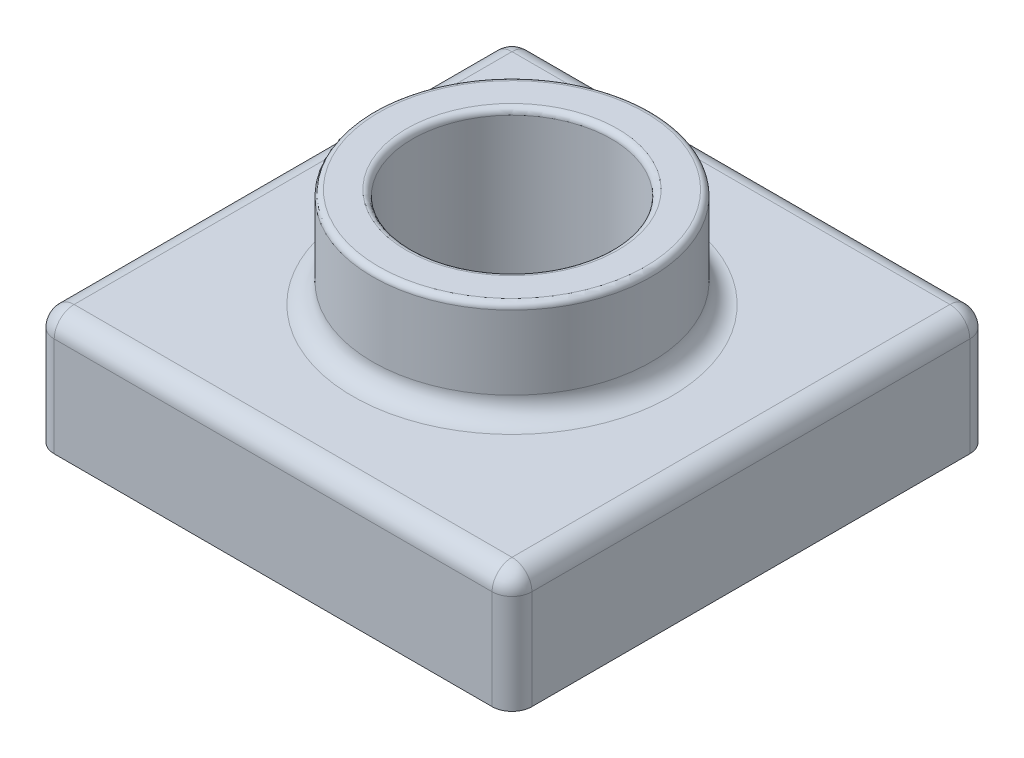
ISO-10303-21;
HEADER;
FILE_DESCRIPTION(('STEP AP214'),'2;1');
FILE_NAME('part.step','',(''),(''),'','','');
FILE_SCHEMA(('AUTOMOTIVE_DESIGN { 1 0 10303 214 1 1 1 1 }'));
ENDSEC;
DATA;
#1=APPLICATION_CONTEXT('core data for automotive mechanical design processes');
#2=APPLICATION_PROTOCOL_DEFINITION('international standard','automotive_design',2000,#1);
#3=PRODUCT_CONTEXT('',#1,'mechanical');
#4=PRODUCT('Part','Part','',(#3));
#5=PRODUCT_RELATED_PRODUCT_CATEGORY('part','',(#4));
#6=PRODUCT_DEFINITION_FORMATION('','',#4);
#7=PRODUCT_DEFINITION_CONTEXT('part definition',#1,'design');
#8=PRODUCT_DEFINITION('design','',#6,#7);
#9=PRODUCT_DEFINITION_SHAPE('','',#8);
#10=(LENGTH_UNIT() NAMED_UNIT(*) SI_UNIT(.MILLI.,.METRE.));
#11=(NAMED_UNIT(*) PLANE_ANGLE_UNIT() SI_UNIT($,.RADIAN.));
#12=(NAMED_UNIT(*) SI_UNIT($,.STERADIAN.) SOLID_ANGLE_UNIT());
#13=UNCERTAINTY_MEASURE_WITH_UNIT(LENGTH_MEASURE(1.E-05),#10,'distance_accuracy_value','');
#14=(GEOMETRIC_REPRESENTATION_CONTEXT(3) GLOBAL_UNCERTAINTY_ASSIGNED_CONTEXT((#13)) GLOBAL_UNIT_ASSIGNED_CONTEXT((#10,
#11,#12)) REPRESENTATION_CONTEXT('',''));
#15=CARTESIAN_POINT('',(0.,0.,0.));
#16=DIRECTION('',(0.,0.,1.));
#17=DIRECTION('',(1.,0.,0.));
#18=AXIS2_PLACEMENT_3D('',#15,#16,#17);
#19=CARTESIAN_POINT('',(0.,0.,0.));
#20=DIRECTION('',(0.,-1.,0.));
#21=DIRECTION('',(0.,0.,-1.));
#22=AXIS2_PLACEMENT_3D('',#19,#20,#21);
#23=PLANE('',#22);
#24=DIRECTION('',(0.,0.,-1.));
#25=VECTOR('',#24,1.);
#26=CARTESIAN_POINT('',(60.,0.,60.));
#27=LINE('',#26,#25);
#28=CARTESIAN_POINT('',(60.,0.,55.));
#29=VERTEX_POINT('',#28);
#30=CARTESIAN_POINT('',(60.,0.,-55.));
#31=VERTEX_POINT('',#30);
#32=EDGE_CURVE('E349',#29,#31,#27,.T.);
#33=ORIENTED_EDGE('',*,*,#32,.F.);
#34=CARTESIAN_POINT('',(55.,0.,55.));
#35=DIRECTION('',(0.,-1.,0.));
#36=DIRECTION('',(0.,0.,-1.));
#37=AXIS2_PLACEMENT_3D('',#34,#35,#36);
#38=CIRCLE('',#37,5.);
#39=CARTESIAN_POINT('',(55.,0.,60.));
#40=VERTEX_POINT('',#39);
#41=EDGE_CURVE('E406',#29,#40,#38,.T.);
#42=ORIENTED_EDGE('',*,*,#41,.T.);
#43=DIRECTION('',(1.,0.,0.));
#44=VECTOR('',#43,1.);
#45=CARTESIAN_POINT('',(-60.,0.,60.));
#46=LINE('',#45,#44);
#47=CARTESIAN_POINT('',(-55.,0.,60.));
#48=VERTEX_POINT('',#47);
#49=EDGE_CURVE('E362',#48,#40,#46,.T.);
#50=ORIENTED_EDGE('',*,*,#49,.F.);
#51=CARTESIAN_POINT('',(-55.,0.,55.));
#52=DIRECTION('',(0.,-1.,0.));
#53=DIRECTION('',(0.,0.,-1.));
#54=AXIS2_PLACEMENT_3D('',#51,#52,#53);
#55=CIRCLE('',#54,5.);
#56=CARTESIAN_POINT('',(-60.,0.,55.));
#57=VERTEX_POINT('',#56);
#58=EDGE_CURVE('E403',#48,#57,#55,.T.);
#59=ORIENTED_EDGE('',*,*,#58,.T.);
#60=DIRECTION('',(0.,0.,1.));
#61=VECTOR('',#60,1.);
#62=CARTESIAN_POINT('',(-60.,0.,60.));
#63=LINE('',#62,#61);
#64=CARTESIAN_POINT('',(-60.,0.,-55.));
#65=VERTEX_POINT('',#64);
#66=EDGE_CURVE('E358',#65,#57,#63,.T.);
#67=ORIENTED_EDGE('',*,*,#66,.F.);
#68=CARTESIAN_POINT('',(-55.,0.,-55.));
#69=DIRECTION('',(0.,-1.,0.));
#70=DIRECTION('',(0.,0.,-1.));
#71=AXIS2_PLACEMENT_3D('',#68,#69,#70);
#72=CIRCLE('',#71,5.);
#73=CARTESIAN_POINT('',(-55.,0.,-60.));
#74=VERTEX_POINT('',#73);
#75=EDGE_CURVE('E397',#65,#74,#72,.T.);
#76=ORIENTED_EDGE('',*,*,#75,.T.);
#77=DIRECTION('',(-1.,0.,0.));
#78=VECTOR('',#77,1.);
#79=CARTESIAN_POINT('',(-60.,0.,-60.));
#80=LINE('',#79,#78);
#81=CARTESIAN_POINT('',(55.,0.,-60.));
#82=VERTEX_POINT('',#81);
#83=EDGE_CURVE('E354',#82,#74,#80,.T.);
#84=ORIENTED_EDGE('',*,*,#83,.F.);
#85=CARTESIAN_POINT('',(55.,0.,-55.));
#86=DIRECTION('',(0.,-1.,0.));
#87=DIRECTION('',(0.,0.,-1.));
#88=AXIS2_PLACEMENT_3D('',#85,#86,#87);
#89=CIRCLE('',#88,5.);
#90=EDGE_CURVE('E400',#82,#31,#89,.T.);
#91=ORIENTED_EDGE('',*,*,#90,.T.);
#92=EDGE_LOOP('',(#33,#42,#50,#59,#67,#76,#84,#91));
#93=FACE_BOUND('',#92,.T.);
#94=CARTESIAN_POINT('',(55.,0.,55.));
#95=DIRECTION('',(0.,-1.,0.));
#96=DIRECTION('',(0.,0.,-1.));
#97=AXIS2_PLACEMENT_3D('',#94,#95,#96);
#98=CIRCLE('',#97,3.);
#99=CARTESIAN_POINT('',(58.,0.,55.));
#100=VERTEX_POINT('',#99);
#101=CARTESIAN_POINT('',(55.,0.,58.));
#102=VERTEX_POINT('',#101);
#103=EDGE_CURVE('E313',#100,#102,#98,.T.);
#104=ORIENTED_EDGE('',*,*,#103,.F.);
#105=DIRECTION('',(0.,0.,-1.));
#106=VECTOR('',#105,1.);
#107=CARTESIAN_POINT('',(58.,0.,0.));
#108=LINE('',#107,#106);
#109=CARTESIAN_POINT('',(58.,0.,-55.));
#110=VERTEX_POINT('',#109);
#111=EDGE_CURVE('E218',#100,#110,#108,.T.);
#112=ORIENTED_EDGE('',*,*,#111,.T.);
#113=CARTESIAN_POINT('',(55.,0.,-55.));
#114=DIRECTION('',(0.,-1.,0.));
#115=DIRECTION('',(0.,0.,-1.));
#116=AXIS2_PLACEMENT_3D('',#113,#114,#115);
#117=CIRCLE('',#116,3.);
#118=CARTESIAN_POINT('',(55.,0.,-58.));
#119=VERTEX_POINT('',#118);
#120=EDGE_CURVE('E226',#119,#110,#117,.T.);
#121=ORIENTED_EDGE('',*,*,#120,.F.);
#122=DIRECTION('',(-1.,0.,0.));
#123=VECTOR('',#122,1.);
#124=CARTESIAN_POINT('',(0.,0.,-58.));
#125=LINE('',#124,#123);
#126=CARTESIAN_POINT('',(-55.,0.,-58.));
#127=VERTEX_POINT('',#126);
#128=EDGE_CURVE('E59',#119,#127,#125,.T.);
#129=ORIENTED_EDGE('',*,*,#128,.T.);
#130=CARTESIAN_POINT('',(-55.,0.,-55.));
#131=DIRECTION('',(0.,-1.,0.));
#132=DIRECTION('',(0.,0.,-1.));
#133=AXIS2_PLACEMENT_3D('',#130,#131,#132);
#134=CIRCLE('',#133,3.);
#135=CARTESIAN_POINT('',(-58.,0.,-55.));
#136=VERTEX_POINT('',#135);
#137=EDGE_CURVE('E221',#136,#127,#134,.T.);
#138=ORIENTED_EDGE('',*,*,#137,.F.);
#139=DIRECTION('',(0.,0.,1.));
#140=VECTOR('',#139,1.);
#141=CARTESIAN_POINT('',(-58.,0.,0.));
#142=LINE('',#141,#140);
#143=CARTESIAN_POINT('',(-58.,0.,55.));
#144=VERTEX_POINT('',#143);
#145=EDGE_CURVE('E332',#136,#144,#142,.T.);
#146=ORIENTED_EDGE('',*,*,#145,.T.);
#147=CARTESIAN_POINT('',(-55.,0.,55.));
#148=DIRECTION('',(0.,-1.,0.));
#149=DIRECTION('',(0.,0.,-1.));
#150=AXIS2_PLACEMENT_3D('',#147,#148,#149);
#151=CIRCLE('',#150,3.);
#152=CARTESIAN_POINT('',(-55.,0.,58.));
#153=VERTEX_POINT('',#152);
#154=EDGE_CURVE('E328',#153,#144,#151,.T.);
#155=ORIENTED_EDGE('',*,*,#154,.F.);
#156=DIRECTION('',(1.,0.,0.));
#157=VECTOR('',#156,1.);
#158=CARTESIAN_POINT('',(0.,0.,58.));
#159=LINE('',#158,#157);
#160=EDGE_CURVE('E289',#153,#102,#159,.T.);
#161=ORIENTED_EDGE('',*,*,#160,.T.);
#162=EDGE_LOOP('',(#104,#112,#121,#129,#138,#146,#155,#161));
#163=FACE_BOUND('',#162,.T.);
#164=ADVANCED_FACE('F43',(#93,#163),#23,.T.);
#165=CARTESIAN_POINT('',(60.,30.,60.));
#166=DIRECTION('',(-1.,0.,0.));
#167=DIRECTION('',(0.,0.,1.));
#168=AXIS2_PLACEMENT_3D('',#165,#166,#167);
#169=PLANE('',#168);
#170=DIRECTION('',(0.,0.,-1.));
#171=VECTOR('',#170,1.);
#172=CARTESIAN_POINT('',(60.,25.,60.));
#173=LINE('',#172,#171);
#174=CARTESIAN_POINT('',(60.,25.,-55.));
#175=VERTEX_POINT('',#174);
#176=CARTESIAN_POINT('',(60.,25.,55.));
#177=VERTEX_POINT('',#176);
#178=EDGE_CURVE('E387',#175,#177,#173,.F.);
#179=ORIENTED_EDGE('',*,*,#178,.T.);
#180=DIRECTION('',(0.,-1.,0.));
#181=VECTOR('',#180,1.);
#182=CARTESIAN_POINT('',(60.,30.,55.));
#183=LINE('',#182,#181);
#184=EDGE_CURVE('E393',#177,#29,#183,.T.);
#185=ORIENTED_EDGE('',*,*,#184,.T.);
#186=ORIENTED_EDGE('',*,*,#32,.T.);
#187=DIRECTION('',(0.,-1.,0.));
#188=VECTOR('',#187,1.);
#189=CARTESIAN_POINT('',(60.,30.,-55.));
#190=LINE('',#189,#188);
#191=EDGE_CURVE('E390',#31,#175,#190,.F.);
#192=ORIENTED_EDGE('',*,*,#191,.T.);
#193=EDGE_LOOP('',(#179,#185,#186,#192));
#194=FACE_BOUND('',#193,.T.);
#195=ADVANCED_FACE('F528',(#194),#169,.F.);
#196=CARTESIAN_POINT('',(-60.,30.,-60.));
#197=DIRECTION('',(0.,0.,1.));
#198=DIRECTION('',(1.,0.,0.));
#199=AXIS2_PLACEMENT_3D('',#196,#197,#198);
#200=PLANE('',#199);
#201=DIRECTION('',(-1.,0.,0.));
#202=VECTOR('',#201,1.);
#203=CARTESIAN_POINT('',(-60.,25.,-60.));
#204=LINE('',#203,#202);
#205=CARTESIAN_POINT('',(-55.,25.,-60.));
#206=VERTEX_POINT('',#205);
#207=CARTESIAN_POINT('',(55.,25.,-60.));
#208=VERTEX_POINT('',#207);
#209=EDGE_CURVE('E67',#206,#208,#204,.F.);
#210=ORIENTED_EDGE('',*,*,#209,.T.);
#211=DIRECTION('',(0.,-1.,0.));
#212=VECTOR('',#211,1.);
#213=CARTESIAN_POINT('',(55.,30.,-60.));
#214=LINE('',#213,#212);
#215=EDGE_CURVE('E432',#208,#82,#214,.T.);
#216=ORIENTED_EDGE('',*,*,#215,.T.);
#217=ORIENTED_EDGE('',*,*,#83,.T.);
#218=DIRECTION('',(0.,-1.,0.));
#219=VECTOR('',#218,1.);
#220=CARTESIAN_POINT('',(-55.,30.,-60.));
#221=LINE('',#220,#219);
#222=EDGE_CURVE('E427',#74,#206,#221,.F.);
#223=ORIENTED_EDGE('',*,*,#222,.T.);
#224=EDGE_LOOP('',(#210,#216,#217,#223));
#225=FACE_BOUND('',#224,.T.);
#226=ADVANCED_FACE('F534',(#225),#200,.F.);
#227=CARTESIAN_POINT('',(-60.,30.,60.));
#228=DIRECTION('',(1.,0.,0.));
#229=DIRECTION('',(0.,0.,-1.));
#230=AXIS2_PLACEMENT_3D('',#227,#228,#229);
#231=PLANE('',#230);
#232=ORIENTED_EDGE('',*,*,#66,.T.);
#233=DIRECTION('',(0.,-1.,0.));
#234=VECTOR('',#233,1.);
#235=CARTESIAN_POINT('',(-60.,30.,55.));
#236=LINE('',#235,#234);
#237=CARTESIAN_POINT('',(-60.,25.,55.));
#238=VERTEX_POINT('',#237);
#239=EDGE_CURVE('E424',#57,#238,#236,.F.);
#240=ORIENTED_EDGE('',*,*,#239,.T.);
#241=DIRECTION('',(0.,0.,1.));
#242=VECTOR('',#241,1.);
#243=CARTESIAN_POINT('',(-60.,25.,60.));
#244=LINE('',#243,#242);
#245=CARTESIAN_POINT('',(-60.,25.,-55.));
#246=VERTEX_POINT('',#245);
#247=EDGE_CURVE('E421',#238,#246,#244,.F.);
#248=ORIENTED_EDGE('',*,*,#247,.T.);
#249=DIRECTION('',(0.,-1.,0.));
#250=VECTOR('',#249,1.);
#251=CARTESIAN_POINT('',(-60.,30.,-55.));
#252=LINE('',#251,#250);
#253=EDGE_CURVE('E418',#246,#65,#252,.T.);
#254=ORIENTED_EDGE('',*,*,#253,.T.);
#255=EDGE_LOOP('',(#232,#240,#248,#254));
#256=FACE_BOUND('',#255,.T.);
#257=ADVANCED_FACE('F923',(#256),#231,.F.);
#258=CARTESIAN_POINT('',(-60.,30.,60.));
#259=DIRECTION('',(0.,0.,-1.));
#260=DIRECTION('',(-1.,0.,0.));
#261=AXIS2_PLACEMENT_3D('',#258,#259,#260);
#262=PLANE('',#261);
#263=ORIENTED_EDGE('',*,*,#49,.T.);
#264=DIRECTION('',(0.,-1.,0.));
#265=VECTOR('',#264,1.);
#266=CARTESIAN_POINT('',(55.,30.,60.));
#267=LINE('',#266,#265);
#268=CARTESIAN_POINT('',(55.,25.,60.));
#269=VERTEX_POINT('',#268);
#270=EDGE_CURVE('E415',#40,#269,#267,.F.);
#271=ORIENTED_EDGE('',*,*,#270,.T.);
#272=DIRECTION('',(1.,0.,0.));
#273=VECTOR('',#272,1.);
#274=CARTESIAN_POINT('',(-60.,25.,60.));
#275=LINE('',#274,#273);
#276=CARTESIAN_POINT('',(-55.,25.,60.));
#277=VERTEX_POINT('',#276);
#278=EDGE_CURVE('E409',#269,#277,#275,.F.);
#279=ORIENTED_EDGE('',*,*,#278,.T.);
#280=DIRECTION('',(0.,-1.,0.));
#281=VECTOR('',#280,1.);
#282=CARTESIAN_POINT('',(-55.,30.,60.));
#283=LINE('',#282,#281);
#284=EDGE_CURVE('E412',#277,#48,#283,.T.);
#285=ORIENTED_EDGE('',*,*,#284,.T.);
#286=EDGE_LOOP('',(#263,#271,#279,#285));
#287=FACE_BOUND('',#286,.T.);
#288=ADVANCED_FACE('F523',(#287),#262,.F.);
#289=CARTESIAN_POINT('',(0.,30.,0.));
#290=DIRECTION('',(0.,-1.,0.));
#291=DIRECTION('',(0.,0.,-1.));
#292=AXIS2_PLACEMENT_3D('',#289,#290,#291);
#293=PLANE('',#292);
#294=CARTESIAN_POINT('',(0.,30.,0.));
#295=DIRECTION('',(0.,-1.,0.));
#296=DIRECTION('',(0.,0.,-1.));
#297=AXIS2_PLACEMENT_3D('',#294,#295,#296);
#298=CIRCLE('',#297,40.);
#299=CARTESIAN_POINT('',(0.,30.,-40.));
#300=VERTEX_POINT('',#299);
#301=EDGE_CURVE('E383',#300,#300,#298,.T.);
#302=ORIENTED_EDGE('',*,*,#301,.T.);
#303=EDGE_LOOP('',(#302));
#304=FACE_BOUND('',#303,.T.);
#305=DIRECTION('',(-1.,0.,0.));
#306=VECTOR('',#305,1.);
#307=CARTESIAN_POINT('',(0.,30.,-55.));
#308=LINE('',#307,#306);
#309=CARTESIAN_POINT('',(55.,30.,-55.));
#310=VERTEX_POINT('',#309);
#311=CARTESIAN_POINT('',(-55.,30.,-55.));
#312=VERTEX_POINT('',#311);
#313=EDGE_CURVE('E370',#310,#312,#308,.T.);
#314=ORIENTED_EDGE('',*,*,#313,.T.);
#315=DIRECTION('',(0.,0.,1.));
#316=VECTOR('',#315,1.);
#317=CARTESIAN_POINT('',(-55.,30.,0.));
#318=LINE('',#317,#316);
#319=CARTESIAN_POINT('',(-55.,30.,55.));
#320=VERTEX_POINT('',#319);
#321=EDGE_CURVE('E379',#312,#320,#318,.T.);
#322=ORIENTED_EDGE('',*,*,#321,.T.);
#323=DIRECTION('',(1.,0.,0.));
#324=VECTOR('',#323,1.);
#325=CARTESIAN_POINT('',(0.,30.,55.));
#326=LINE('',#325,#324);
#327=CARTESIAN_POINT('',(55.,30.,55.));
#328=VERTEX_POINT('',#327);
#329=EDGE_CURVE('E376',#320,#328,#326,.T.);
#330=ORIENTED_EDGE('',*,*,#329,.T.);
#331=DIRECTION('',(0.,0.,-1.));
#332=VECTOR('',#331,1.);
#333=CARTESIAN_POINT('',(55.,30.,0.));
#334=LINE('',#333,#332);
#335=EDGE_CURVE('E373',#328,#310,#334,.T.);
#336=ORIENTED_EDGE('',*,*,#335,.T.);
#337=EDGE_LOOP('',(#314,#322,#330,#336));
#338=FACE_BOUND('',#337,.T.);
#339=ADVANCED_FACE('F512',(#304,#338),#293,.F.);
#340=CARTESIAN_POINT('',(0.,0.,0.));
#341=DIRECTION('',(0.,-1.,0.));
#342=DIRECTION('',(0.,0.,-1.));
#343=AXIS2_PLACEMENT_3D('',#340,#341,#342);
#344=CIRCLE('',#343,27.);
#345=CARTESIAN_POINT('',(0.,0.,-27.));
#346=VERTEX_POINT('',#345);
#347=EDGE_CURVE('E251',#346,#346,#344,.F.);
#348=ORIENTED_EDGE('',*,*,#347,.F.);
#349=EDGE_LOOP('',(#348));
#350=FACE_BOUND('',#349,.T.);
#351=CARTESIAN_POINT('',(0.,0.,0.));
#352=DIRECTION('',(0.,1.,0.));
#353=DIRECTION('',(0.,0.,1.));
#354=AXIS2_PLACEMENT_3D('',#351,#352,#353);
#355=CIRCLE('',#354,25.);
#356=CARTESIAN_POINT('',(0.,0.,25.));
#357=VERTEX_POINT('',#356);
#358=EDGE_CURVE('E345',#357,#357,#355,.T.);
#359=ORIENTED_EDGE('',*,*,#358,.T.);
#360=EDGE_LOOP('',(#359));
#361=FACE_BOUND('',#360,.T.);
#362=ADVANCED_FACE('F509',(#350,#361),#23,.T.);
#363=CARTESIAN_POINT('',(0.,55.,0.));
#364=DIRECTION('',(0.,-1.,0.));
#365=DIRECTION('',(0.,0.,-1.));
#366=AXIS2_PLACEMENT_3D('',#363,#364,#365);
#367=CYLINDRICAL_SURFACE('',#366,35.);
#368=CARTESIAN_POINT('',(0.,53.5,0.));
#369=DIRECTION('',(0.,1.,0.));
#370=DIRECTION('',(0.,0.,1.));
#371=AXIS2_PLACEMENT_3D('',#368,#369,#370);
#372=CIRCLE('',#371,35.);
#373=CARTESIAN_POINT('',(0.,53.5,35.));
#374=VERTEX_POINT('',#373);
#375=EDGE_CURVE('E11',#374,#374,#372,.F.);
#376=ORIENTED_EDGE('',*,*,#375,.T.);
#377=EDGE_LOOP('',(#376));
#378=FACE_BOUND('',#377,.T.);
#379=CARTESIAN_POINT('',(0.,35.,0.));
#380=DIRECTION('',(0.,-1.,0.));
#381=DIRECTION('',(0.,0.,-1.));
#382=AXIS2_PLACEMENT_3D('',#379,#380,#381);
#383=CIRCLE('',#382,35.);
#384=CARTESIAN_POINT('',(0.,35.,-35.));
#385=VERTEX_POINT('',#384);
#386=EDGE_CURVE('E366',#385,#385,#383,.F.);
#387=ORIENTED_EDGE('',*,*,#386,.T.);
#388=EDGE_LOOP('',(#387));
#389=FACE_BOUND('',#388,.T.);
#390=ADVANCED_FACE('F511',(#378,#389),#367,.T.);
#391=CARTESIAN_POINT('',(0.,55.,0.));
#392=DIRECTION('',(0.,1.,0.));
#393=DIRECTION('',(0.,0.,1.));
#394=AXIS2_PLACEMENT_3D('',#391,#392,#393);
#395=PLANE('',#394);
#396=CARTESIAN_POINT('',(0.,55.,0.));
#397=DIRECTION('',(0.,1.,0.));
#398=DIRECTION('',(0.,0.,1.));
#399=AXIS2_PLACEMENT_3D('',#396,#397,#398);
#400=CIRCLE('',#399,26.5);
#401=CARTESIAN_POINT('',(0.,55.,26.5));
#402=VERTEX_POINT('',#401);
#403=EDGE_CURVE('E52',#402,#402,#400,.F.);
#404=ORIENTED_EDGE('',*,*,#403,.T.);
#405=EDGE_LOOP('',(#404));
#406=FACE_BOUND('',#405,.T.);
#407=CARTESIAN_POINT('',(0.,55.,0.));
#408=DIRECTION('',(0.,1.,0.));
#409=DIRECTION('',(0.,0.,1.));
#410=AXIS2_PLACEMENT_3D('',#407,#408,#409);
#411=CIRCLE('',#410,33.5);
#412=CARTESIAN_POINT('',(0.,55.,33.5));
#413=VERTEX_POINT('',#412);
#414=EDGE_CURVE('E485',#413,#413,#411,.T.);
#415=ORIENTED_EDGE('',*,*,#414,.T.);
#416=EDGE_LOOP('',(#415));
#417=FACE_BOUND('',#416,.T.);
#418=ADVANCED_FACE('F493',(#406,#417),#395,.T.);
#419=CARTESIAN_POINT('',(0.,0.,0.));
#420=DIRECTION('',(0.,1.,0.));
#421=DIRECTION('',(0.,0.,1.));
#422=AXIS2_PLACEMENT_3D('',#419,#420,#421);
#423=CYLINDRICAL_SURFACE('',#422,25.);
#424=CARTESIAN_POINT('',(0.,53.5,0.));
#425=DIRECTION('',(0.,1.,0.));
#426=DIRECTION('',(0.,0.,1.));
#427=AXIS2_PLACEMENT_3D('',#424,#425,#426);
#428=CIRCLE('',#427,25.);
#429=CARTESIAN_POINT('',(0.,53.5,25.));
#430=VERTEX_POINT('',#429);
#431=EDGE_CURVE('E435',#430,#430,#428,.T.);
#432=ORIENTED_EDGE('',*,*,#431,.T.);
#433=EDGE_LOOP('',(#432));
#434=FACE_BOUND('',#433,.T.);
#435=ORIENTED_EDGE('',*,*,#358,.F.);
#436=EDGE_LOOP('',(#435));
#437=FACE_BOUND('',#436,.T.);
#438=ADVANCED_FACE('F502',(#434,#437),#423,.F.);
#439=CARTESIAN_POINT('',(0.,35.,0.));
#440=DIRECTION('',(0.,-1.,0.));
#441=DIRECTION('',(0.,0.,-1.));
#442=AXIS2_PLACEMENT_3D('',#439,#440,#441);
#443=TOROIDAL_SURFACE('',#442,40.,5.);
#444=ORIENTED_EDGE('',*,*,#301,.F.);
#445=EDGE_LOOP('',(#444));
#446=FACE_BOUND('',#445,.T.);
#447=ORIENTED_EDGE('',*,*,#386,.F.);
#448=EDGE_LOOP('',(#447));
#449=FACE_BOUND('',#448,.T.);
#450=ADVANCED_FACE('F505',(#446,#449),#443,.F.);
#451=CARTESIAN_POINT('',(-55.,30.,-55.));
#452=DIRECTION('',(0.,-1.,0.));
#453=DIRECTION('',(0.,0.,-1.));
#454=AXIS2_PLACEMENT_3D('',#451,#452,#453);
#455=CYLINDRICAL_SURFACE('',#454,5.);
#456=CARTESIAN_POINT('',(-55.,25.,-55.));
#457=DIRECTION('',(0.,1.,0.));
#458=DIRECTION('',(0.,0.,1.));
#459=AXIS2_PLACEMENT_3D('',#456,#457,#458);
#460=CIRCLE('',#459,5.);
#461=EDGE_CURVE('E350',#206,#246,#460,.T.);
#462=ORIENTED_EDGE('',*,*,#461,.F.);
#463=ORIENTED_EDGE('',*,*,#222,.F.);
#464=ORIENTED_EDGE('',*,*,#75,.F.);
#465=ORIENTED_EDGE('',*,*,#253,.F.);
#466=EDGE_LOOP('',(#462,#463,#464,#465));
#467=FACE_BOUND('',#466,.T.);
#468=ADVANCED_FACE('F884',(#467),#455,.T.);
#469=CARTESIAN_POINT('',(-55.,25.,-55.));
#470=DIRECTION('',(-1.,0.,0.));
#471=DIRECTION('',(0.,0.,1.));
#472=AXIS2_PLACEMENT_3D('',#469,#470,#471);
#473=SPHERICAL_SURFACE('',#472,5.);
#474=CARTESIAN_POINT('',(-55.,25.,-55.));
#475=DIRECTION('',(-1.,0.,0.));
#476=DIRECTION('',(0.,0.,1.));
#477=AXIS2_PLACEMENT_3D('',#474,#475,#476);
#478=CIRCLE('',#477,5.);
#479=EDGE_CURVE('E471',#206,#312,#478,.F.);
#480=ORIENTED_EDGE('',*,*,#479,.F.);
#481=ORIENTED_EDGE('',*,*,#461,.T.);
#482=CARTESIAN_POINT('',(-55.,25.,-55.));
#483=DIRECTION('',(0.,0.,-1.));
#484=DIRECTION('',(0.,1.,0.));
#485=AXIS2_PLACEMENT_3D('',#482,#483,#484);
#486=CIRCLE('',#485,5.);
#487=EDGE_CURVE('E475',#312,#246,#486,.F.);
#488=ORIENTED_EDGE('',*,*,#487,.F.);
#489=EDGE_LOOP('',(#480,#481,#488));
#490=FACE_BOUND('',#489,.T.);
#491=ADVANCED_FACE('F875',(#490),#473,.T.);
#492=CARTESIAN_POINT('',(-55.,30.,55.));
#493=DIRECTION('',(0.,-1.,0.));
#494=DIRECTION('',(0.,0.,-1.));
#495=AXIS2_PLACEMENT_3D('',#492,#493,#494);
#496=CYLINDRICAL_SURFACE('',#495,5.);
#497=ORIENTED_EDGE('',*,*,#58,.F.);
#498=ORIENTED_EDGE('',*,*,#284,.F.);
#499=CARTESIAN_POINT('',(-55.,25.,55.));
#500=DIRECTION('',(0.,1.,0.));
#501=DIRECTION('',(0.,0.,1.));
#502=AXIS2_PLACEMENT_3D('',#499,#500,#501);
#503=CIRCLE('',#502,5.);
#504=EDGE_CURVE('E467',#238,#277,#503,.T.);
#505=ORIENTED_EDGE('',*,*,#504,.F.);
#506=ORIENTED_EDGE('',*,*,#239,.F.);
#507=EDGE_LOOP('',(#497,#498,#505,#506));
#508=FACE_BOUND('',#507,.T.);
#509=ADVANCED_FACE('F866',(#508),#496,.T.);
#510=CARTESIAN_POINT('',(-55.,25.,0.));
#511=DIRECTION('',(0.,0.,1.));
#512=DIRECTION('',(1.,0.,0.));
#513=AXIS2_PLACEMENT_3D('',#510,#511,#512);
#514=CYLINDRICAL_SURFACE('',#513,5.);
#515=ORIENTED_EDGE('',*,*,#487,.T.);
#516=ORIENTED_EDGE('',*,*,#247,.F.);
#517=CARTESIAN_POINT('',(-55.,25.,55.));
#518=DIRECTION('',(0.,0.,1.));
#519=DIRECTION('',(1.,0.,0.));
#520=AXIS2_PLACEMENT_3D('',#517,#518,#519);
#521=CIRCLE('',#520,5.);
#522=EDGE_CURVE('E463',#320,#238,#521,.T.);
#523=ORIENTED_EDGE('',*,*,#522,.F.);
#524=ORIENTED_EDGE('',*,*,#321,.F.);
#525=EDGE_LOOP('',(#515,#516,#523,#524));
#526=FACE_BOUND('',#525,.T.);
#527=ADVANCED_FACE('F857',(#526),#514,.T.);
#528=CARTESIAN_POINT('',(0.,25.,-55.));
#529=DIRECTION('',(-1.,0.,0.));
#530=DIRECTION('',(0.,0.,1.));
#531=AXIS2_PLACEMENT_3D('',#528,#529,#530);
#532=CYLINDRICAL_SURFACE('',#531,5.);
#533=ORIENTED_EDGE('',*,*,#479,.T.);
#534=ORIENTED_EDGE('',*,*,#313,.F.);
#535=CARTESIAN_POINT('',(55.,25.,-55.));
#536=DIRECTION('',(1.,0.,0.));
#537=DIRECTION('',(0.,1.,0.));
#538=AXIS2_PLACEMENT_3D('',#535,#536,#537);
#539=CIRCLE('',#538,5.);
#540=EDGE_CURVE('E459',#208,#310,#539,.T.);
#541=ORIENTED_EDGE('',*,*,#540,.F.);
#542=ORIENTED_EDGE('',*,*,#209,.F.);
#543=EDGE_LOOP('',(#533,#534,#541,#542));
#544=FACE_BOUND('',#543,.T.);
#545=ADVANCED_FACE('F848',(#544),#532,.T.);
#546=CARTESIAN_POINT('',(55.,30.,-55.));
#547=DIRECTION('',(0.,-1.,0.));
#548=DIRECTION('',(0.,0.,-1.));
#549=AXIS2_PLACEMENT_3D('',#546,#547,#548);
#550=CYLINDRICAL_SURFACE('',#549,5.);
#551=ORIENTED_EDGE('',*,*,#90,.F.);
#552=ORIENTED_EDGE('',*,*,#215,.F.);
#553=CARTESIAN_POINT('',(55.,25.,-55.));
#554=DIRECTION('',(0.,1.,0.));
#555=DIRECTION('',(0.,0.,1.));
#556=AXIS2_PLACEMENT_3D('',#553,#554,#555);
#557=CIRCLE('',#556,5.);
#558=EDGE_CURVE('E455',#175,#208,#557,.T.);
#559=ORIENTED_EDGE('',*,*,#558,.F.);
#560=ORIENTED_EDGE('',*,*,#191,.F.);
#561=EDGE_LOOP('',(#551,#552,#559,#560));
#562=FACE_BOUND('',#561,.T.);
#563=ADVANCED_FACE('F839',(#562),#550,.T.);
#564=CARTESIAN_POINT('',(-55.,25.,55.));
#565=DIRECTION('',(-1.,0.,0.));
#566=DIRECTION('',(0.,0.,1.));
#567=AXIS2_PLACEMENT_3D('',#564,#565,#566);
#568=SPHERICAL_SURFACE('',#567,5.);
#569=ORIENTED_EDGE('',*,*,#522,.T.);
#570=ORIENTED_EDGE('',*,*,#504,.T.);
#571=CARTESIAN_POINT('',(-55.,25.,55.));
#572=DIRECTION('',(-1.,0.,0.));
#573=DIRECTION('',(0.,0.,1.));
#574=AXIS2_PLACEMENT_3D('',#571,#572,#573);
#575=CIRCLE('',#574,5.);
#576=EDGE_CURVE('E451',#320,#277,#575,.F.);
#577=ORIENTED_EDGE('',*,*,#576,.F.);
#578=EDGE_LOOP('',(#569,#570,#577));
#579=FACE_BOUND('',#578,.T.);
#580=ADVANCED_FACE('F830',(#579),#568,.T.);
#581=CARTESIAN_POINT('',(55.,25.,-55.));
#582=DIRECTION('',(0.,0.,-1.));
#583=DIRECTION('',(-1.,0.,0.));
#584=AXIS2_PLACEMENT_3D('',#581,#582,#583);
#585=SPHERICAL_SURFACE('',#584,5.);
#586=ORIENTED_EDGE('',*,*,#558,.T.);
#587=ORIENTED_EDGE('',*,*,#540,.T.);
#588=CARTESIAN_POINT('',(55.,25.,-55.));
#589=DIRECTION('',(0.,0.,-1.));
#590=DIRECTION('',(-1.,0.,0.));
#591=AXIS2_PLACEMENT_3D('',#588,#589,#590);
#592=CIRCLE('',#591,5.);
#593=EDGE_CURVE('E447',#175,#310,#592,.F.);
#594=ORIENTED_EDGE('',*,*,#593,.F.);
#595=EDGE_LOOP('',(#586,#587,#594));
#596=FACE_BOUND('',#595,.T.);
#597=ADVANCED_FACE('F821',(#596),#585,.T.);
#598=CARTESIAN_POINT('',(0.,25.,55.));
#599=DIRECTION('',(1.,0.,0.));
#600=DIRECTION('',(0.,0.,-1.));
#601=AXIS2_PLACEMENT_3D('',#598,#599,#600);
#602=CYLINDRICAL_SURFACE('',#601,5.);
#603=ORIENTED_EDGE('',*,*,#576,.T.);
#604=ORIENTED_EDGE('',*,*,#278,.F.);
#605=CARTESIAN_POINT('',(55.,25.,55.));
#606=DIRECTION('',(1.,0.,0.));
#607=DIRECTION('',(0.,0.,-1.));
#608=AXIS2_PLACEMENT_3D('',#605,#606,#607);
#609=CIRCLE('',#608,5.);
#610=EDGE_CURVE('E443',#328,#269,#609,.T.);
#611=ORIENTED_EDGE('',*,*,#610,.F.);
#612=ORIENTED_EDGE('',*,*,#329,.F.);
#613=EDGE_LOOP('',(#603,#604,#611,#612));
#614=FACE_BOUND('',#613,.T.);
#615=ADVANCED_FACE('F812',(#614),#602,.T.);
#616=CARTESIAN_POINT('',(55.,25.,0.));
#617=DIRECTION('',(0.,0.,-1.));
#618=DIRECTION('',(-1.,0.,0.));
#619=AXIS2_PLACEMENT_3D('',#616,#617,#618);
#620=CYLINDRICAL_SURFACE('',#619,5.);
#621=ORIENTED_EDGE('',*,*,#593,.T.);
#622=ORIENTED_EDGE('',*,*,#335,.F.);
#623=CARTESIAN_POINT('',(55.,25.,55.));
#624=DIRECTION('',(0.,0.,1.));
#625=DIRECTION('',(1.,0.,0.));
#626=AXIS2_PLACEMENT_3D('',#623,#624,#625);
#627=CIRCLE('',#626,5.);
#628=EDGE_CURVE('E439',#177,#328,#627,.T.);
#629=ORIENTED_EDGE('',*,*,#628,.F.);
#630=ORIENTED_EDGE('',*,*,#178,.F.);
#631=EDGE_LOOP('',(#621,#622,#629,#630));
#632=FACE_BOUND('',#631,.T.);
#633=ADVANCED_FACE('F803',(#632),#620,.T.);
#634=CARTESIAN_POINT('',(55.,25.,55.));
#635=DIRECTION('',(0.,1.,0.));
#636=DIRECTION('',(0.,0.,1.));
#637=AXIS2_PLACEMENT_3D('',#634,#635,#636);
#638=SPHERICAL_SURFACE('',#637,5.);
#639=ORIENTED_EDGE('',*,*,#628,.T.);
#640=ORIENTED_EDGE('',*,*,#610,.T.);
#641=CARTESIAN_POINT('',(55.,25.,55.));
#642=DIRECTION('',(0.,1.,0.));
#643=DIRECTION('',(0.,0.,1.));
#644=AXIS2_PLACEMENT_3D('',#641,#642,#643);
#645=CIRCLE('',#644,5.);
#646=EDGE_CURVE('E294',#177,#269,#645,.F.);
#647=ORIENTED_EDGE('',*,*,#646,.F.);
#648=EDGE_LOOP('',(#639,#640,#647));
#649=FACE_BOUND('',#648,.T.);
#650=ADVANCED_FACE('F794',(#649),#638,.T.);
#651=CARTESIAN_POINT('',(55.,30.,55.));
#652=DIRECTION('',(0.,-1.,0.));
#653=DIRECTION('',(0.,0.,-1.));
#654=AXIS2_PLACEMENT_3D('',#651,#652,#653);
#655=CYLINDRICAL_SURFACE('',#654,5.);
#656=ORIENTED_EDGE('',*,*,#646,.T.);
#657=ORIENTED_EDGE('',*,*,#270,.F.);
#658=ORIENTED_EDGE('',*,*,#41,.F.);
#659=ORIENTED_EDGE('',*,*,#184,.F.);
#660=EDGE_LOOP('',(#656,#657,#658,#659));
#661=FACE_BOUND('',#660,.T.);
#662=ADVANCED_FACE('F499',(#661),#655,.T.);
#663=CARTESIAN_POINT('',(0.,53.5,0.));
#664=DIRECTION('',(0.,1.,0.));
#665=DIRECTION('',(0.,0.,1.));
#666=AXIS2_PLACEMENT_3D('',#663,#664,#665);
#667=TOROIDAL_SURFACE('',#666,26.5,1.5);
#668=ORIENTED_EDGE('',*,*,#403,.F.);
#669=EDGE_LOOP('',(#668));
#670=FACE_BOUND('',#669,.T.);
#671=ORIENTED_EDGE('',*,*,#431,.F.);
#672=EDGE_LOOP('',(#671));
#673=FACE_BOUND('',#672,.T.);
#674=ADVANCED_FACE('F496',(#670,#673),#667,.T.);
#675=CARTESIAN_POINT('',(0.,53.5,0.));
#676=DIRECTION('',(0.,1.,0.));
#677=DIRECTION('',(0.,0.,1.));
#678=AXIS2_PLACEMENT_3D('',#675,#676,#677);
#679=TOROIDAL_SURFACE('',#678,33.5,1.5);
#680=ORIENTED_EDGE('',*,*,#375,.F.);
#681=EDGE_LOOP('',(#680));
#682=FACE_BOUND('',#681,.T.);
#683=ORIENTED_EDGE('',*,*,#414,.F.);
#684=EDGE_LOOP('',(#683));
#685=FACE_BOUND('',#684,.T.);
#686=ADVANCED_FACE('F45',(#682,#685),#679,.T.);
#687=CARTESIAN_POINT('',(58.,30.,60.));
#688=DIRECTION('',(-1.,0.,0.));
#689=DIRECTION('',(0.,0.,1.));
#690=AXIS2_PLACEMENT_3D('',#687,#688,#689);
#691=PLANE('',#690);
#692=DIRECTION('',(0.,0.,1.));
#693=VECTOR('',#692,1.);
#694=CARTESIAN_POINT('',(58.,25.,60.));
#695=LINE('',#694,#693);
#696=CARTESIAN_POINT('',(58.,25.,-55.));
#697=VERTEX_POINT('',#696);
#698=CARTESIAN_POINT('',(58.,25.,55.));
#699=VERTEX_POINT('',#698);
#700=EDGE_CURVE('E184',#697,#699,#695,.T.);
#701=ORIENTED_EDGE('',*,*,#700,.F.);
#702=DIRECTION('',(0.,1.,0.));
#703=VECTOR('',#702,1.);
#704=CARTESIAN_POINT('',(58.,30.,-55.));
#705=LINE('',#704,#703);
#706=EDGE_CURVE('E194',#110,#697,#705,.T.);
#707=ORIENTED_EDGE('',*,*,#706,.F.);
#708=ORIENTED_EDGE('',*,*,#111,.F.);
#709=DIRECTION('',(0.,1.,0.));
#710=VECTOR('',#709,1.);
#711=CARTESIAN_POINT('',(58.,30.,55.));
#712=LINE('',#711,#710);
#713=EDGE_CURVE('E209',#699,#100,#712,.F.);
#714=ORIENTED_EDGE('',*,*,#713,.F.);
#715=EDGE_LOOP('',(#701,#707,#708,#714));
#716=FACE_BOUND('',#715,.T.);
#717=ADVANCED_FACE('F216',(#716),#691,.T.);
#718=CARTESIAN_POINT('',(-60.,30.,-58.));
#719=DIRECTION('',(0.,0.,1.));
#720=DIRECTION('',(1.,0.,0.));
#721=AXIS2_PLACEMENT_3D('',#718,#719,#720);
#722=PLANE('',#721);
#723=DIRECTION('',(1.,0.,0.));
#724=VECTOR('',#723,1.);
#725=CARTESIAN_POINT('',(-60.,25.,-58.));
#726=LINE('',#725,#724);
#727=CARTESIAN_POINT('',(-55.,25.,-58.));
#728=VERTEX_POINT('',#727);
#729=CARTESIAN_POINT('',(55.,25.,-58.));
#730=VERTEX_POINT('',#729);
#731=EDGE_CURVE('E234',#728,#730,#726,.T.);
#732=ORIENTED_EDGE('',*,*,#731,.F.);
#733=DIRECTION('',(0.,1.,0.));
#734=VECTOR('',#733,1.);
#735=CARTESIAN_POINT('',(-55.,30.,-58.));
#736=LINE('',#735,#734);
#737=EDGE_CURVE('E243',#127,#728,#736,.T.);
#738=ORIENTED_EDGE('',*,*,#737,.F.);
#739=ORIENTED_EDGE('',*,*,#128,.F.);
#740=DIRECTION('',(0.,1.,0.));
#741=VECTOR('',#740,1.);
#742=CARTESIAN_POINT('',(55.,30.,-58.));
#743=LINE('',#742,#741);
#744=EDGE_CURVE('E230',#730,#119,#743,.F.);
#745=ORIENTED_EDGE('',*,*,#744,.F.);
#746=EDGE_LOOP('',(#732,#738,#739,#745));
#747=FACE_BOUND('',#746,.T.);
#748=ADVANCED_FACE('F570',(#747),#722,.T.);
#749=CARTESIAN_POINT('',(-58.,30.,60.));
#750=DIRECTION('',(1.,0.,0.));
#751=DIRECTION('',(0.,0.,-1.));
#752=AXIS2_PLACEMENT_3D('',#749,#750,#751);
#753=PLANE('',#752);
#754=ORIENTED_EDGE('',*,*,#145,.F.);
#755=DIRECTION('',(0.,1.,0.));
#756=VECTOR('',#755,1.);
#757=CARTESIAN_POINT('',(-58.,30.,-55.));
#758=LINE('',#757,#756);
#759=CARTESIAN_POINT('',(-58.,25.,-55.));
#760=VERTEX_POINT('',#759);
#761=EDGE_CURVE('E253',#760,#136,#758,.F.);
#762=ORIENTED_EDGE('',*,*,#761,.F.);
#763=DIRECTION('',(0.,0.,-1.));
#764=VECTOR('',#763,1.);
#765=CARTESIAN_POINT('',(-58.,25.,60.));
#766=LINE('',#765,#764);
#767=CARTESIAN_POINT('',(-58.,25.,55.));
#768=VERTEX_POINT('',#767);
#769=EDGE_CURVE('E256',#768,#760,#766,.T.);
#770=ORIENTED_EDGE('',*,*,#769,.F.);
#771=DIRECTION('',(0.,1.,0.));
#772=VECTOR('',#771,1.);
#773=CARTESIAN_POINT('',(-58.,30.,55.));
#774=LINE('',#773,#772);
#775=EDGE_CURVE('E246',#144,#768,#774,.T.);
#776=ORIENTED_EDGE('',*,*,#775,.F.);
#777=EDGE_LOOP('',(#754,#762,#770,#776));
#778=FACE_BOUND('',#777,.T.);
#779=ADVANCED_FACE('F572',(#778),#753,.T.);
#780=CARTESIAN_POINT('',(-60.,30.,58.));
#781=DIRECTION('',(0.,0.,-1.));
#782=DIRECTION('',(-1.,0.,0.));
#783=AXIS2_PLACEMENT_3D('',#780,#781,#782);
#784=PLANE('',#783);
#785=ORIENTED_EDGE('',*,*,#160,.F.);
#786=DIRECTION('',(0.,1.,0.));
#787=VECTOR('',#786,1.);
#788=CARTESIAN_POINT('',(-55.,30.,58.));
#789=LINE('',#788,#787);
#790=CARTESIAN_POINT('',(-55.,25.,58.));
#791=VERTEX_POINT('',#790);
#792=EDGE_CURVE('E302',#791,#153,#789,.F.);
#793=ORIENTED_EDGE('',*,*,#792,.F.);
#794=DIRECTION('',(-1.,0.,0.));
#795=VECTOR('',#794,1.);
#796=CARTESIAN_POINT('',(-60.,25.,58.));
#797=LINE('',#796,#795);
#798=CARTESIAN_POINT('',(55.,25.,58.));
#799=VERTEX_POINT('',#798);
#800=EDGE_CURVE('E305',#799,#791,#797,.T.);
#801=ORIENTED_EDGE('',*,*,#800,.F.);
#802=DIRECTION('',(0.,1.,0.));
#803=VECTOR('',#802,1.);
#804=CARTESIAN_POINT('',(55.,30.,58.));
#805=LINE('',#804,#803);
#806=EDGE_CURVE('E212',#102,#799,#805,.T.);
#807=ORIENTED_EDGE('',*,*,#806,.F.);
#808=EDGE_LOOP('',(#785,#793,#801,#807));
#809=FACE_BOUND('',#808,.T.);
#810=ADVANCED_FACE('F543',(#809),#784,.T.);
#811=CARTESIAN_POINT('',(0.,28.,0.));
#812=DIRECTION('',(0.,-1.,0.));
#813=DIRECTION('',(0.,0.,-1.));
#814=AXIS2_PLACEMENT_3D('',#811,#812,#813);
#815=PLANE('',#814);
#816=CARTESIAN_POINT('',(0.,28.,0.));
#817=DIRECTION('',(0.,-1.,0.));
#818=DIRECTION('',(0.,0.,-1.));
#819=AXIS2_PLACEMENT_3D('',#816,#817,#818);
#820=CIRCLE('',#819,40.);
#821=CARTESIAN_POINT('',(0.,28.,-40.));
#822=VERTEX_POINT('',#821);
#823=EDGE_CURVE('E195',#822,#822,#820,.T.);
#824=ORIENTED_EDGE('',*,*,#823,.F.);
#825=EDGE_LOOP('',(#824));
#826=FACE_BOUND('',#825,.T.);
#827=DIRECTION('',(1.,0.,0.));
#828=VECTOR('',#827,1.);
#829=CARTESIAN_POINT('',(0.,28.,-55.));
#830=LINE('',#829,#828);
#831=CARTESIAN_POINT('',(55.,28.,-55.));
#832=VERTEX_POINT('',#831);
#833=CARTESIAN_POINT('',(-55.,28.,-55.));
#834=VERTEX_POINT('',#833);
#835=EDGE_CURVE('E273',#832,#834,#830,.F.);
#836=ORIENTED_EDGE('',*,*,#835,.F.);
#837=DIRECTION('',(0.,0.,-1.));
#838=VECTOR('',#837,1.);
#839=CARTESIAN_POINT('',(55.,28.,0.));
#840=LINE('',#839,#838);
#841=CARTESIAN_POINT('',(55.,28.,55.));
#842=VERTEX_POINT('',#841);
#843=EDGE_CURVE('E276',#842,#832,#840,.T.);
#844=ORIENTED_EDGE('',*,*,#843,.F.);
#845=DIRECTION('',(1.,0.,0.));
#846=VECTOR('',#845,1.);
#847=CARTESIAN_POINT('',(0.,28.,55.));
#848=LINE('',#847,#846);
#849=CARTESIAN_POINT('',(-55.,28.,55.));
#850=VERTEX_POINT('',#849);
#851=EDGE_CURVE('E281',#850,#842,#848,.T.);
#852=ORIENTED_EDGE('',*,*,#851,.F.);
#853=DIRECTION('',(0.,0.,-1.));
#854=VECTOR('',#853,1.);
#855=CARTESIAN_POINT('',(-55.,28.,0.));
#856=LINE('',#855,#854);
#857=EDGE_CURVE('E272',#834,#850,#856,.F.);
#858=ORIENTED_EDGE('',*,*,#857,.F.);
#859=EDGE_LOOP('',(#836,#844,#852,#858));
#860=FACE_BOUND('',#859,.T.);
#861=ADVANCED_FACE('F553',(#826,#860),#815,.T.);
#862=CARTESIAN_POINT('',(0.,55.,0.));
#863=DIRECTION('',(0.,-1.,0.));
#864=DIRECTION('',(0.,0.,-1.));
#865=AXIS2_PLACEMENT_3D('',#862,#863,#864);
#866=CYLINDRICAL_SURFACE('',#865,33.);
#867=CARTESIAN_POINT('',(0.,53.,0.));
#868=DIRECTION('',(0.,1.,0.));
#869=DIRECTION('',(0.,0.,1.));
#870=AXIS2_PLACEMENT_3D('',#867,#868,#869);
#871=CIRCLE('',#870,33.);
#872=CARTESIAN_POINT('',(0.,53.,33.));
#873=VERTEX_POINT('',#872);
#874=EDGE_CURVE('E290',#873,#873,#871,.T.);
#875=ORIENTED_EDGE('',*,*,#874,.T.);
#876=EDGE_LOOP('',(#875));
#877=FACE_BOUND('',#876,.T.);
#878=CARTESIAN_POINT('',(0.,35.,0.));
#879=DIRECTION('',(0.,-1.,0.));
#880=DIRECTION('',(0.,0.,-1.));
#881=AXIS2_PLACEMENT_3D('',#878,#879,#880);
#882=CIRCLE('',#881,33.);
#883=CARTESIAN_POINT('',(0.,35.,-33.));
#884=VERTEX_POINT('',#883);
#885=EDGE_CURVE('E277',#884,#884,#882,.F.);
#886=ORIENTED_EDGE('',*,*,#885,.F.);
#887=EDGE_LOOP('',(#886));
#888=FACE_BOUND('',#887,.T.);
#889=ADVANCED_FACE('F585',(#877,#888),#866,.F.);
#890=CARTESIAN_POINT('',(0.,53.,0.));
#891=DIRECTION('',(0.,1.,0.));
#892=DIRECTION('',(0.,0.,1.));
#893=AXIS2_PLACEMENT_3D('',#890,#891,#892);
#894=PLANE('',#893);
#895=CARTESIAN_POINT('',(0.,53.,0.));
#896=DIRECTION('',(0.,1.,0.));
#897=DIRECTION('',(0.,0.,1.));
#898=AXIS2_PLACEMENT_3D('',#895,#896,#897);
#899=CIRCLE('',#898,27.);
#900=CARTESIAN_POINT('',(0.,53.,27.));
#901=VERTEX_POINT('',#900);
#902=EDGE_CURVE('E233',#901,#901,#899,.T.);
#903=ORIENTED_EDGE('',*,*,#902,.T.);
#904=EDGE_LOOP('',(#903));
#905=FACE_BOUND('',#904,.T.);
#906=ORIENTED_EDGE('',*,*,#874,.F.);
#907=EDGE_LOOP('',(#906));
#908=FACE_BOUND('',#907,.T.);
#909=ADVANCED_FACE('F589',(#905,#908),#894,.F.);
#910=CARTESIAN_POINT('',(0.,0.,0.));
#911=DIRECTION('',(0.,1.,0.));
#912=DIRECTION('',(0.,0.,1.));
#913=AXIS2_PLACEMENT_3D('',#910,#911,#912);
#914=CYLINDRICAL_SURFACE('',#913,27.);
#915=ORIENTED_EDGE('',*,*,#902,.F.);
#916=EDGE_LOOP('',(#915));
#917=FACE_BOUND('',#916,.T.);
#918=ORIENTED_EDGE('',*,*,#347,.T.);
#919=EDGE_LOOP('',(#918));
#920=FACE_BOUND('',#919,.T.);
#921=ADVANCED_FACE('F593',(#917,#920),#914,.T.);
#922=CARTESIAN_POINT('',(0.,35.,0.));
#923=DIRECTION('',(0.,-1.,0.));
#924=DIRECTION('',(0.,0.,-1.));
#925=AXIS2_PLACEMENT_3D('',#922,#923,#924);
#926=TOROIDAL_SURFACE('',#925,40.,7.);
#927=ORIENTED_EDGE('',*,*,#823,.T.);
#928=EDGE_LOOP('',(#927));
#929=FACE_BOUND('',#928,.T.);
#930=ORIENTED_EDGE('',*,*,#885,.T.);
#931=EDGE_LOOP('',(#930));
#932=FACE_BOUND('',#931,.T.);
#933=ADVANCED_FACE('F597',(#929,#932),#926,.T.);
#934=CARTESIAN_POINT('',(-55.,30.,-55.));
#935=DIRECTION('',(0.,-1.,0.));
#936=DIRECTION('',(0.,0.,-1.));
#937=AXIS2_PLACEMENT_3D('',#934,#935,#936);
#938=CYLINDRICAL_SURFACE('',#937,3.);
#939=CARTESIAN_POINT('',(-55.,25.,-55.));
#940=DIRECTION('',(0.,1.,0.));
#941=DIRECTION('',(0.,0.,1.));
#942=AXIS2_PLACEMENT_3D('',#939,#940,#941);
#943=CIRCLE('',#942,3.);
#944=EDGE_CURVE('E247',#728,#760,#943,.T.);
#945=ORIENTED_EDGE('',*,*,#944,.T.);
#946=ORIENTED_EDGE('',*,*,#761,.T.);
#947=ORIENTED_EDGE('',*,*,#137,.T.);
#948=ORIENTED_EDGE('',*,*,#737,.T.);
#949=EDGE_LOOP('',(#945,#946,#947,#948));
#950=FACE_BOUND('',#949,.T.);
#951=ADVANCED_FACE('F567',(#950),#938,.F.);
#952=CARTESIAN_POINT('',(-55.,25.,-55.));
#953=DIRECTION('',(-1.,0.,0.));
#954=DIRECTION('',(0.,0.,1.));
#955=AXIS2_PLACEMENT_3D('',#952,#953,#954);
#956=SPHERICAL_SURFACE('',#955,3.);
#957=CARTESIAN_POINT('',(-55.,25.,-55.));
#958=DIRECTION('',(-1.,0.,0.));
#959=DIRECTION('',(0.,0.,1.));
#960=AXIS2_PLACEMENT_3D('',#957,#958,#959);
#961=CIRCLE('',#960,3.);
#962=EDGE_CURVE('E261',#728,#834,#961,.F.);
#963=ORIENTED_EDGE('',*,*,#962,.T.);
#964=CARTESIAN_POINT('',(-55.,25.,-55.));
#965=DIRECTION('',(0.,0.,1.));
#966=DIRECTION('',(1.,0.,0.));
#967=AXIS2_PLACEMENT_3D('',#964,#965,#966);
#968=CIRCLE('',#967,3.);
#969=EDGE_CURVE('E252',#834,#760,#968,.T.);
#970=ORIENTED_EDGE('',*,*,#969,.T.);
#971=ORIENTED_EDGE('',*,*,#944,.F.);
#972=EDGE_LOOP('',(#963,#970,#971));
#973=FACE_BOUND('',#972,.T.);
#974=ADVANCED_FACE('F604',(#973),#956,.F.);
#975=CARTESIAN_POINT('',(-55.,30.,55.));
#976=DIRECTION('',(0.,-1.,0.));
#977=DIRECTION('',(0.,0.,-1.));
#978=AXIS2_PLACEMENT_3D('',#975,#976,#977);
#979=CYLINDRICAL_SURFACE('',#978,3.);
#980=ORIENTED_EDGE('',*,*,#154,.T.);
#981=ORIENTED_EDGE('',*,*,#775,.T.);
#982=CARTESIAN_POINT('',(-55.,25.,55.));
#983=DIRECTION('',(0.,-1.,0.));
#984=DIRECTION('',(0.,0.,-1.));
#985=AXIS2_PLACEMENT_3D('',#982,#983,#984);
#986=CIRCLE('',#985,3.);
#987=EDGE_CURVE('E265',#768,#791,#986,.F.);
#988=ORIENTED_EDGE('',*,*,#987,.T.);
#989=ORIENTED_EDGE('',*,*,#792,.T.);
#990=EDGE_LOOP('',(#980,#981,#988,#989));
#991=FACE_BOUND('',#990,.T.);
#992=ADVANCED_FACE('F607',(#991),#979,.F.);
#993=CARTESIAN_POINT('',(-55.,25.,0.));
#994=DIRECTION('',(0.,0.,1.));
#995=DIRECTION('',(1.,0.,0.));
#996=AXIS2_PLACEMENT_3D('',#993,#994,#995);
#997=CYLINDRICAL_SURFACE('',#996,3.);
#998=ORIENTED_EDGE('',*,*,#969,.F.);
#999=ORIENTED_EDGE('',*,*,#857,.T.);
#1000=CARTESIAN_POINT('',(-55.,25.,55.));
#1001=DIRECTION('',(0.,0.,1.));
#1002=DIRECTION('',(0.,-1.,0.));
#1003=AXIS2_PLACEMENT_3D('',#1000,#1001,#1002);
#1004=CIRCLE('',#1003,3.);
#1005=EDGE_CURVE('E298',#850,#768,#1004,.T.);
#1006=ORIENTED_EDGE('',*,*,#1005,.T.);
#1007=ORIENTED_EDGE('',*,*,#769,.T.);
#1008=EDGE_LOOP('',(#998,#999,#1006,#1007));
#1009=FACE_BOUND('',#1008,.T.);
#1010=ADVANCED_FACE('F611',(#1009),#997,.F.);
#1011=CARTESIAN_POINT('',(0.,25.,-55.));
#1012=DIRECTION('',(-1.,0.,0.));
#1013=DIRECTION('',(0.,0.,1.));
#1014=AXIS2_PLACEMENT_3D('',#1011,#1012,#1013);
#1015=CYLINDRICAL_SURFACE('',#1014,3.);
#1016=ORIENTED_EDGE('',*,*,#962,.F.);
#1017=ORIENTED_EDGE('',*,*,#731,.T.);
#1018=CARTESIAN_POINT('',(55.,25.,-55.));
#1019=DIRECTION('',(-1.,0.,0.));
#1020=DIRECTION('',(0.,-1.,0.));
#1021=AXIS2_PLACEMENT_3D('',#1018,#1019,#1020);
#1022=CIRCLE('',#1021,3.);
#1023=EDGE_CURVE('E239',#730,#832,#1022,.F.);
#1024=ORIENTED_EDGE('',*,*,#1023,.T.);
#1025=ORIENTED_EDGE('',*,*,#835,.T.);
#1026=EDGE_LOOP('',(#1016,#1017,#1024,#1025));
#1027=FACE_BOUND('',#1026,.T.);
#1028=ADVANCED_FACE('F557',(#1027),#1015,.F.);
#1029=CARTESIAN_POINT('',(55.,30.,-55.));
#1030=DIRECTION('',(0.,-1.,0.));
#1031=DIRECTION('',(0.,0.,-1.));
#1032=AXIS2_PLACEMENT_3D('',#1029,#1030,#1031);
#1033=CYLINDRICAL_SURFACE('',#1032,3.);
#1034=ORIENTED_EDGE('',*,*,#120,.T.);
#1035=ORIENTED_EDGE('',*,*,#706,.T.);
#1036=CARTESIAN_POINT('',(55.,25.,-55.));
#1037=DIRECTION('',(0.,1.,0.));
#1038=DIRECTION('',(-1.,0.,0.));
#1039=AXIS2_PLACEMENT_3D('',#1036,#1037,#1038);
#1040=CIRCLE('',#1039,3.);
#1041=EDGE_CURVE('E235',#697,#730,#1040,.T.);
#1042=ORIENTED_EDGE('',*,*,#1041,.T.);
#1043=ORIENTED_EDGE('',*,*,#744,.T.);
#1044=EDGE_LOOP('',(#1034,#1035,#1042,#1043));
#1045=FACE_BOUND('',#1044,.T.);
#1046=ADVANCED_FACE('F563',(#1045),#1033,.F.);
#1047=CARTESIAN_POINT('',(-55.,25.,55.));
#1048=DIRECTION('',(-1.,0.,0.));
#1049=DIRECTION('',(0.,0.,1.));
#1050=AXIS2_PLACEMENT_3D('',#1047,#1048,#1049);
#1051=SPHERICAL_SURFACE('',#1050,3.);
#1052=ORIENTED_EDGE('',*,*,#1005,.F.);
#1053=CARTESIAN_POINT('',(-55.,25.,55.));
#1054=DIRECTION('',(1.,0.,0.));
#1055=DIRECTION('',(0.,0.,-1.));
#1056=AXIS2_PLACEMENT_3D('',#1053,#1054,#1055);
#1057=CIRCLE('',#1056,3.);
#1058=EDGE_CURVE('E240',#850,#791,#1057,.T.);
#1059=ORIENTED_EDGE('',*,*,#1058,.T.);
#1060=ORIENTED_EDGE('',*,*,#987,.F.);
#1061=EDGE_LOOP('',(#1052,#1059,#1060));
#1062=FACE_BOUND('',#1061,.T.);
#1063=ADVANCED_FACE('F620',(#1062),#1051,.F.);
#1064=CARTESIAN_POINT('',(55.,25.,-55.));
#1065=DIRECTION('',(0.,0.,-1.));
#1066=DIRECTION('',(-1.,0.,0.));
#1067=AXIS2_PLACEMENT_3D('',#1064,#1065,#1066);
#1068=SPHERICAL_SURFACE('',#1067,3.);
#1069=ORIENTED_EDGE('',*,*,#1041,.F.);
#1070=CARTESIAN_POINT('',(55.,25.,-55.));
#1071=DIRECTION('',(0.,0.,-1.));
#1072=DIRECTION('',(-1.,0.,0.));
#1073=AXIS2_PLACEMENT_3D('',#1070,#1071,#1072);
#1074=CIRCLE('',#1073,3.);
#1075=EDGE_CURVE('E189',#697,#832,#1074,.F.);
#1076=ORIENTED_EDGE('',*,*,#1075,.T.);
#1077=ORIENTED_EDGE('',*,*,#1023,.F.);
#1078=EDGE_LOOP('',(#1069,#1076,#1077));
#1079=FACE_BOUND('',#1078,.T.);
#1080=ADVANCED_FACE('F561',(#1079),#1068,.F.);
#1081=CARTESIAN_POINT('',(0.,25.,55.));
#1082=DIRECTION('',(1.,0.,0.));
#1083=DIRECTION('',(0.,0.,-1.));
#1084=AXIS2_PLACEMENT_3D('',#1081,#1082,#1083);
#1085=CYLINDRICAL_SURFACE('',#1084,3.);
#1086=ORIENTED_EDGE('',*,*,#1058,.F.);
#1087=ORIENTED_EDGE('',*,*,#851,.T.);
#1088=CARTESIAN_POINT('',(55.,25.,55.));
#1089=DIRECTION('',(-1.,0.,0.));
#1090=DIRECTION('',(0.,0.,1.));
#1091=AXIS2_PLACEMENT_3D('',#1088,#1089,#1090);
#1092=CIRCLE('',#1091,3.);
#1093=EDGE_CURVE('E204',#842,#799,#1092,.F.);
#1094=ORIENTED_EDGE('',*,*,#1093,.T.);
#1095=ORIENTED_EDGE('',*,*,#800,.T.);
#1096=EDGE_LOOP('',(#1086,#1087,#1094,#1095));
#1097=FACE_BOUND('',#1096,.T.);
#1098=ADVANCED_FACE('F547',(#1097),#1085,.F.);
#1099=CARTESIAN_POINT('',(55.,25.,0.));
#1100=DIRECTION('',(0.,0.,-1.));
#1101=DIRECTION('',(-1.,0.,0.));
#1102=AXIS2_PLACEMENT_3D('',#1099,#1100,#1101);
#1103=CYLINDRICAL_SURFACE('',#1102,3.);
#1104=ORIENTED_EDGE('',*,*,#1075,.F.);
#1105=ORIENTED_EDGE('',*,*,#700,.T.);
#1106=CARTESIAN_POINT('',(55.,25.,55.));
#1107=DIRECTION('',(0.,0.,1.));
#1108=DIRECTION('',(1.,0.,0.));
#1109=AXIS2_PLACEMENT_3D('',#1106,#1107,#1108);
#1110=CIRCLE('',#1109,3.);
#1111=EDGE_CURVE('E187',#699,#842,#1110,.T.);
#1112=ORIENTED_EDGE('',*,*,#1111,.T.);
#1113=ORIENTED_EDGE('',*,*,#843,.T.);
#1114=EDGE_LOOP('',(#1104,#1105,#1112,#1113));
#1115=FACE_BOUND('',#1114,.T.);
#1116=ADVANCED_FACE('F186',(#1115),#1103,.F.);
#1117=CARTESIAN_POINT('',(55.,25.,55.));
#1118=DIRECTION('',(0.,1.,0.));
#1119=DIRECTION('',(0.,0.,1.));
#1120=AXIS2_PLACEMENT_3D('',#1117,#1118,#1119);
#1121=SPHERICAL_SURFACE('',#1120,3.);
#1122=ORIENTED_EDGE('',*,*,#1111,.F.);
#1123=CARTESIAN_POINT('',(55.,25.,55.));
#1124=DIRECTION('',(0.,-1.,0.));
#1125=DIRECTION('',(0.,0.,-1.));
#1126=AXIS2_PLACEMENT_3D('',#1123,#1124,#1125);
#1127=CIRCLE('',#1126,3.);
#1128=EDGE_CURVE('E202',#699,#799,#1127,.T.);
#1129=ORIENTED_EDGE('',*,*,#1128,.T.);
#1130=ORIENTED_EDGE('',*,*,#1093,.F.);
#1131=EDGE_LOOP('',(#1122,#1129,#1130));
#1132=FACE_BOUND('',#1131,.T.);
#1133=ADVANCED_FACE('F201',(#1132),#1121,.F.);
#1134=CARTESIAN_POINT('',(55.,30.,55.));
#1135=DIRECTION('',(0.,-1.,0.));
#1136=DIRECTION('',(0.,0.,-1.));
#1137=AXIS2_PLACEMENT_3D('',#1134,#1135,#1136);
#1138=CYLINDRICAL_SURFACE('',#1137,3.);
#1139=ORIENTED_EDGE('',*,*,#1128,.F.);
#1140=ORIENTED_EDGE('',*,*,#713,.T.);
#1141=ORIENTED_EDGE('',*,*,#103,.T.);
#1142=ORIENTED_EDGE('',*,*,#806,.T.);
#1143=EDGE_LOOP('',(#1139,#1140,#1141,#1142));
#1144=FACE_BOUND('',#1143,.T.);
#1145=ADVANCED_FACE('F208',(#1144),#1138,.F.);
#1146=CLOSED_SHELL('',(#164,#195,#226,#257,#288,#339,#362,#390,#418,#438,#450,#468,#491,#509,
#527,#545,#563,#580,#597,#615,#633,#650,#662,#674,#686,#717,#748,#779,#810,#861,#889,#909,#921,
#933,#951,#974,#992,#1010,#1028,#1046,#1063,#1080,#1098,#1116,#1133,#1145));
#1147=MANIFOLD_SOLID_BREP('B2',#1146);
#1148=ADVANCED_BREP_SHAPE_REPRESENTATION('',(#18,#1147),#14);
#1149=SHAPE_DEFINITION_REPRESENTATION(#9,#1148);
ENDSEC;
END-ISO-10303-21;
